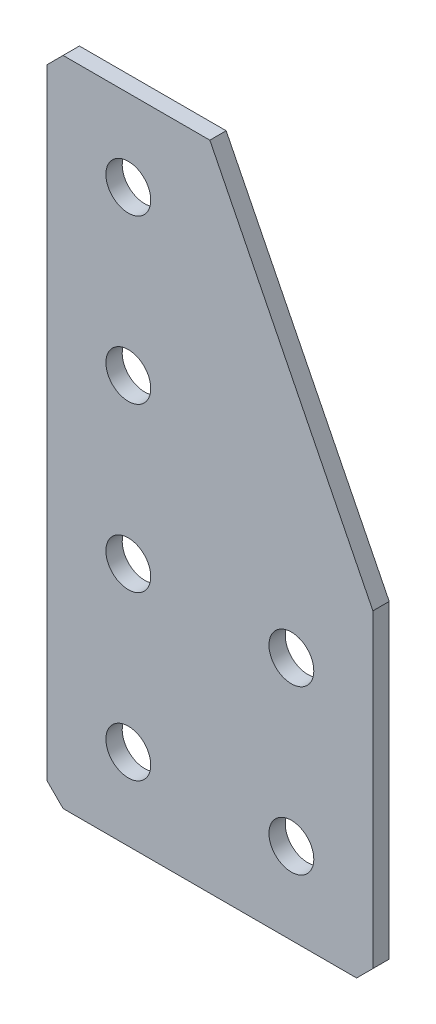
ISO-10303-21;
HEADER;
FILE_DESCRIPTION(('STEP AP214'),'2;1');
FILE_NAME('part.step','',(''),(''),'','','');
FILE_SCHEMA(('AUTOMOTIVE_DESIGN { 1 0 10303 214 1 1 1 1 }'));
ENDSEC;
DATA;
#1=APPLICATION_CONTEXT('core data for automotive mechanical design processes');
#2=APPLICATION_PROTOCOL_DEFINITION('international standard','automotive_design',2000,#1);
#3=PRODUCT_CONTEXT('',#1,'mechanical');
#4=PRODUCT('Part','Part','',(#3));
#5=PRODUCT_RELATED_PRODUCT_CATEGORY('part','',(#4));
#6=PRODUCT_DEFINITION_FORMATION('','',#4);
#7=PRODUCT_DEFINITION_CONTEXT('part definition',#1,'design');
#8=PRODUCT_DEFINITION('design','',#6,#7);
#9=PRODUCT_DEFINITION_SHAPE('','',#8);
#10=(LENGTH_UNIT() NAMED_UNIT(*) SI_UNIT(.MILLI.,.METRE.));
#11=(NAMED_UNIT(*) PLANE_ANGLE_UNIT() SI_UNIT($,.RADIAN.));
#12=(NAMED_UNIT(*) SI_UNIT($,.STERADIAN.) SOLID_ANGLE_UNIT());
#13=UNCERTAINTY_MEASURE_WITH_UNIT(LENGTH_MEASURE(1.E-05),#10,'distance_accuracy_value','');
#14=(GEOMETRIC_REPRESENTATION_CONTEXT(3) GLOBAL_UNCERTAINTY_ASSIGNED_CONTEXT((#13)) GLOBAL_UNIT_ASSIGNED_CONTEXT((#10,
#11,#12)) REPRESENTATION_CONTEXT('',''));
#15=CARTESIAN_POINT('',(0.,0.,0.));
#16=DIRECTION('',(0.,0.,1.));
#17=DIRECTION('',(1.,0.,0.));
#18=AXIS2_PLACEMENT_3D('',#15,#16,#17);
#19=CARTESIAN_POINT('',(20.,0.,-2.));
#20=DIRECTION('',(0.,-1.,0.));
#21=DIRECTION('',(1.,0.,0.));
#22=AXIS2_PLACEMENT_3D('',#19,#20,#21);
#23=PLANE('',#22);
#24=DIRECTION('',(1.,0.,0.));
#25=VECTOR('',#24,1.);
#26=CARTESIAN_POINT('',(20.,0.,-2.));
#27=LINE('',#26,#25);
#28=CARTESIAN_POINT('',(2.00000000000002,0.,-2.));
#29=VERTEX_POINT('',#28);
#30=CARTESIAN_POINT('',(20.,0.,-2.));
#31=VERTEX_POINT('',#30);
#32=EDGE_CURVE('E110',#29,#31,#27,.T.);
#33=ORIENTED_EDGE('',*,*,#32,.F.);
#34=DIRECTION('',(0.,0.,1.));
#35=VECTOR('',#34,1.);
#36=CARTESIAN_POINT('',(2.00000000000002,0.,-2.));
#37=LINE('',#36,#35);
#38=CARTESIAN_POINT('',(2.00000000000002,0.,0.));
#39=VERTEX_POINT('',#38);
#40=EDGE_CURVE('E139',#29,#39,#37,.T.);
#41=ORIENTED_EDGE('',*,*,#40,.T.);
#42=DIRECTION('',(1.,0.,0.));
#43=VECTOR('',#42,1.);
#44=CARTESIAN_POINT('',(20.,0.,0.));
#45=LINE('',#44,#43);
#46=CARTESIAN_POINT('',(20.,0.,0.));
#47=VERTEX_POINT('',#46);
#48=EDGE_CURVE('E136',#39,#47,#45,.T.);
#49=ORIENTED_EDGE('',*,*,#48,.T.);
#50=DIRECTION('',(0.,0.,1.));
#51=VECTOR('',#50,1.);
#52=CARTESIAN_POINT('',(20.,0.,-2.));
#53=LINE('',#52,#51);
#54=EDGE_CURVE('E128',#31,#47,#53,.T.);
#55=ORIENTED_EDGE('',*,*,#54,.F.);
#56=EDGE_LOOP('',(#33,#41,#49,#55));
#57=FACE_BOUND('',#56,.T.);
#58=ADVANCED_FACE('F45',(#57),#23,.F.);
#59=CARTESIAN_POINT('',(40.,-40.,-2.));
#60=DIRECTION('',(-0.894427190999916,-0.447213595499958,0.));
#61=DIRECTION('',(0.447213595499958,-0.894427190999916,0.));
#62=AXIS2_PLACEMENT_3D('',#59,#60,#61);
#63=PLANE('',#62);
#64=DIRECTION('',(0.447213595499958,-0.894427190999916,0.));
#65=VECTOR('',#64,1.);
#66=CARTESIAN_POINT('',(40.,-40.,0.));
#67=LINE('',#66,#65);
#68=CARTESIAN_POINT('',(40.,-40.,0.));
#69=VERTEX_POINT('',#68);
#70=EDGE_CURVE('E197',#47,#69,#67,.T.);
#71=ORIENTED_EDGE('',*,*,#70,.T.);
#72=DIRECTION('',(0.,0.,1.));
#73=VECTOR('',#72,1.);
#74=CARTESIAN_POINT('',(40.,-40.,-2.));
#75=LINE('',#74,#73);
#76=CARTESIAN_POINT('',(40.,-40.,-2.));
#77=VERTEX_POINT('',#76);
#78=EDGE_CURVE('E130',#77,#69,#75,.T.);
#79=ORIENTED_EDGE('',*,*,#78,.F.);
#80=DIRECTION('',(0.447213595499958,-0.894427190999916,0.));
#81=VECTOR('',#80,1.);
#82=CARTESIAN_POINT('',(40.,-40.,-2.));
#83=LINE('',#82,#81);
#84=EDGE_CURVE('E114',#31,#77,#83,.T.);
#85=ORIENTED_EDGE('',*,*,#84,.F.);
#86=ORIENTED_EDGE('',*,*,#54,.T.);
#87=EDGE_LOOP('',(#71,#79,#85,#86));
#88=FACE_BOUND('',#87,.T.);
#89=ADVANCED_FACE('F127',(#88),#63,.F.);
#90=CARTESIAN_POINT('',(40.,-80.,-2.));
#91=DIRECTION('',(-1.,0.,0.));
#92=DIRECTION('',(0.,0.,1.));
#93=AXIS2_PLACEMENT_3D('',#90,#91,#92);
#94=PLANE('',#93);
#95=DIRECTION('',(0.,-1.,0.));
#96=VECTOR('',#95,1.);
#97=CARTESIAN_POINT('',(40.,-80.,0.));
#98=LINE('',#97,#96);
#99=CARTESIAN_POINT('',(40.,-78.,0.));
#100=VERTEX_POINT('',#99);
#101=EDGE_CURVE('E190',#69,#100,#98,.T.);
#102=ORIENTED_EDGE('',*,*,#101,.T.);
#103=DIRECTION('',(0.,0.,-1.));
#104=VECTOR('',#103,1.);
#105=CARTESIAN_POINT('',(40.,-78.,-2.));
#106=LINE('',#105,#104);
#107=CARTESIAN_POINT('',(40.,-78.,-2.));
#108=VERTEX_POINT('',#107);
#109=EDGE_CURVE('E11',#100,#108,#106,.T.);
#110=ORIENTED_EDGE('',*,*,#109,.T.);
#111=DIRECTION('',(0.,-1.,0.));
#112=VECTOR('',#111,1.);
#113=CARTESIAN_POINT('',(40.,-80.,-2.));
#114=LINE('',#113,#112);
#115=EDGE_CURVE('E133',#77,#108,#114,.T.);
#116=ORIENTED_EDGE('',*,*,#115,.F.);
#117=ORIENTED_EDGE('',*,*,#78,.T.);
#118=EDGE_LOOP('',(#102,#110,#116,#117));
#119=FACE_BOUND('',#118,.T.);
#120=ADVANCED_FACE('F297',(#119),#94,.F.);
#121=CARTESIAN_POINT('',(0.,-80.,-2.));
#122=DIRECTION('',(0.,1.,0.));
#123=DIRECTION('',(0.,0.,1.));
#124=AXIS2_PLACEMENT_3D('',#121,#122,#123);
#125=PLANE('',#124);
#126=DIRECTION('',(-1.,0.,0.));
#127=VECTOR('',#126,1.);
#128=CARTESIAN_POINT('',(0.,-80.,-2.));
#129=LINE('',#128,#127);
#130=CARTESIAN_POINT('',(38.,-80.,-2.));
#131=VERTEX_POINT('',#130);
#132=CARTESIAN_POINT('',(2.,-80.,-2.));
#133=VERTEX_POINT('',#132);
#134=EDGE_CURVE('E182',#131,#133,#129,.T.);
#135=ORIENTED_EDGE('',*,*,#134,.F.);
#136=DIRECTION('',(0.,0.,1.));
#137=VECTOR('',#136,1.);
#138=CARTESIAN_POINT('',(38.,-80.,-2.));
#139=LINE('',#138,#137);
#140=CARTESIAN_POINT('',(38.,-80.,0.));
#141=VERTEX_POINT('',#140);
#142=EDGE_CURVE('E54',#131,#141,#139,.T.);
#143=ORIENTED_EDGE('',*,*,#142,.T.);
#144=DIRECTION('',(-1.,0.,0.));
#145=VECTOR('',#144,1.);
#146=CARTESIAN_POINT('',(0.,-80.,0.));
#147=LINE('',#146,#145);
#148=CARTESIAN_POINT('',(2.,-80.,0.));
#149=VERTEX_POINT('',#148);
#150=EDGE_CURVE('E181',#141,#149,#147,.T.);
#151=ORIENTED_EDGE('',*,*,#150,.T.);
#152=DIRECTION('',(0.,0.,-1.));
#153=VECTOR('',#152,1.);
#154=CARTESIAN_POINT('',(2.,-80.,-2.));
#155=LINE('',#154,#153);
#156=EDGE_CURVE('E61',#149,#133,#155,.T.);
#157=ORIENTED_EDGE('',*,*,#156,.T.);
#158=EDGE_LOOP('',(#135,#143,#151,#157));
#159=FACE_BOUND('',#158,.T.);
#160=ADVANCED_FACE('F180',(#159),#125,.F.);
#161=CARTESIAN_POINT('',(0.,0.,-2.));
#162=DIRECTION('',(1.,0.,0.));
#163=DIRECTION('',(0.,0.,-1.));
#164=AXIS2_PLACEMENT_3D('',#161,#162,#163);
#165=PLANE('',#164);
#166=DIRECTION('',(0.,1.,0.));
#167=VECTOR('',#166,1.);
#168=CARTESIAN_POINT('',(0.,0.,0.));
#169=LINE('',#168,#167);
#170=CARTESIAN_POINT('',(0.,-78.,0.));
#171=VERTEX_POINT('',#170);
#172=CARTESIAN_POINT('',(0.,-2.00000000000003,0.));
#173=VERTEX_POINT('',#172);
#174=EDGE_CURVE('E123',#171,#173,#169,.T.);
#175=ORIENTED_EDGE('',*,*,#174,.T.);
#176=DIRECTION('',(0.,0.,-1.));
#177=VECTOR('',#176,1.);
#178=CARTESIAN_POINT('',(0.,-2.00000000000003,-2.));
#179=LINE('',#178,#177);
#180=CARTESIAN_POINT('',(0.,-2.00000000000003,-2.));
#181=VERTEX_POINT('',#180);
#182=EDGE_CURVE('E163',#173,#181,#179,.T.);
#183=ORIENTED_EDGE('',*,*,#182,.T.);
#184=DIRECTION('',(0.,1.,0.));
#185=VECTOR('',#184,1.);
#186=CARTESIAN_POINT('',(0.,0.,-2.));
#187=LINE('',#186,#185);
#188=CARTESIAN_POINT('',(0.,-78.,-2.));
#189=VERTEX_POINT('',#188);
#190=EDGE_CURVE('E147',#189,#181,#187,.T.);
#191=ORIENTED_EDGE('',*,*,#190,.F.);
#192=DIRECTION('',(0.,0.,1.));
#193=VECTOR('',#192,1.);
#194=CARTESIAN_POINT('',(0.,-78.,-2.));
#195=LINE('',#194,#193);
#196=EDGE_CURVE('E159',#189,#171,#195,.T.);
#197=ORIENTED_EDGE('',*,*,#196,.T.);
#198=EDGE_LOOP('',(#175,#183,#191,#197));
#199=FACE_BOUND('',#198,.T.);
#200=ADVANCED_FACE('F265',(#199),#165,.F.);
#201=CARTESIAN_POINT('',(0.,0.,-2.));
#202=DIRECTION('',(0.,0.,1.));
#203=DIRECTION('',(1.,0.,0.));
#204=AXIS2_PLACEMENT_3D('',#201,#202,#203);
#205=PLANE('',#204);
#206=CARTESIAN_POINT('',(10.,-70.,-2.));
#207=DIRECTION('',(0.,0.,-1.));
#208=DIRECTION('',(0.,1.,0.));
#209=AXIS2_PLACEMENT_3D('',#206,#207,#208);
#210=CIRCLE('',#209,2.75);
#211=CARTESIAN_POINT('',(10.,-67.25,-2.));
#212=VERTEX_POINT('',#211);
#213=EDGE_CURVE('E254',#212,#212,#210,.T.);
#214=ORIENTED_EDGE('',*,*,#213,.F.);
#215=EDGE_LOOP('',(#214));
#216=FACE_BOUND('',#215,.T.);
#217=CARTESIAN_POINT('',(10.,-50.,-2.));
#218=DIRECTION('',(0.,0.,-1.));
#219=DIRECTION('',(0.,1.,0.));
#220=AXIS2_PLACEMENT_3D('',#217,#218,#219);
#221=CIRCLE('',#220,2.75);
#222=CARTESIAN_POINT('',(10.,-47.25,-2.));
#223=VERTEX_POINT('',#222);
#224=EDGE_CURVE('E246',#223,#223,#221,.T.);
#225=ORIENTED_EDGE('',*,*,#224,.F.);
#226=EDGE_LOOP('',(#225));
#227=FACE_BOUND('',#226,.T.);
#228=CARTESIAN_POINT('',(10.,-30.,-2.));
#229=DIRECTION('',(0.,0.,-1.));
#230=DIRECTION('',(0.,1.,0.));
#231=AXIS2_PLACEMENT_3D('',#228,#229,#230);
#232=CIRCLE('',#231,2.75);
#233=CARTESIAN_POINT('',(10.,-27.25,-2.));
#234=VERTEX_POINT('',#233);
#235=EDGE_CURVE('E238',#234,#234,#232,.T.);
#236=ORIENTED_EDGE('',*,*,#235,.F.);
#237=EDGE_LOOP('',(#236));
#238=FACE_BOUND('',#237,.T.);
#239=CARTESIAN_POINT('',(10.,-9.99999999999999,-2.));
#240=DIRECTION('',(0.,0.,-1.));
#241=DIRECTION('',(0.,1.,0.));
#242=AXIS2_PLACEMENT_3D('',#239,#240,#241);
#243=CIRCLE('',#242,2.75);
#244=CARTESIAN_POINT('',(10.,-7.24999999999999,-2.));
#245=VERTEX_POINT('',#244);
#246=EDGE_CURVE('E230',#245,#245,#243,.T.);
#247=ORIENTED_EDGE('',*,*,#246,.F.);
#248=EDGE_LOOP('',(#247));
#249=FACE_BOUND('',#248,.T.);
#250=CARTESIAN_POINT('',(30.,-70.,-2.));
#251=DIRECTION('',(0.,0.,-1.));
#252=DIRECTION('',(0.,1.,0.));
#253=AXIS2_PLACEMENT_3D('',#250,#251,#252);
#254=CIRCLE('',#253,2.75);
#255=CARTESIAN_POINT('',(30.,-67.25,-2.));
#256=VERTEX_POINT('',#255);
#257=EDGE_CURVE('E222',#256,#256,#254,.T.);
#258=ORIENTED_EDGE('',*,*,#257,.F.);
#259=EDGE_LOOP('',(#258));
#260=FACE_BOUND('',#259,.T.);
#261=CARTESIAN_POINT('',(30.,-50.,-2.));
#262=DIRECTION('',(0.,0.,-1.));
#263=DIRECTION('',(0.,1.,0.));
#264=AXIS2_PLACEMENT_3D('',#261,#262,#263);
#265=CIRCLE('',#264,2.75);
#266=CARTESIAN_POINT('',(30.,-47.25,-2.));
#267=VERTEX_POINT('',#266);
#268=EDGE_CURVE('E214',#267,#267,#265,.T.);
#269=ORIENTED_EDGE('',*,*,#268,.F.);
#270=EDGE_LOOP('',(#269));
#271=FACE_BOUND('',#270,.T.);
#272=ORIENTED_EDGE('',*,*,#190,.T.);
#273=DIRECTION('',(-0.707106781186545,-0.70710678118655,0.));
#274=VECTOR('',#273,1.);
#275=CARTESIAN_POINT('',(2.00000000000002,0.,-2.));
#276=LINE('',#275,#274);
#277=EDGE_CURVE('E117',#181,#29,#276,.F.);
#278=ORIENTED_EDGE('',*,*,#277,.T.);
#279=ORIENTED_EDGE('',*,*,#32,.T.);
#280=ORIENTED_EDGE('',*,*,#84,.T.);
#281=ORIENTED_EDGE('',*,*,#115,.T.);
#282=DIRECTION('',(0.707106781186548,0.707106781186548,0.));
#283=VECTOR('',#282,1.);
#284=CARTESIAN_POINT('',(38.,-80.,-2.));
#285=LINE('',#284,#283);
#286=EDGE_CURVE('E68',#108,#131,#285,.F.);
#287=ORIENTED_EDGE('',*,*,#286,.T.);
#288=ORIENTED_EDGE('',*,*,#134,.T.);
#289=DIRECTION('',(0.70710678118655,-0.707106781186545,0.));
#290=VECTOR('',#289,1.);
#291=CARTESIAN_POINT('',(0.,-78.,-2.));
#292=LINE('',#291,#290);
#293=EDGE_CURVE('E166',#133,#189,#292,.F.);
#294=ORIENTED_EDGE('',*,*,#293,.T.);
#295=EDGE_LOOP('',(#272,#278,#279,#280,#281,#287,#288,#294));
#296=FACE_BOUND('',#295,.T.);
#297=ADVANCED_FACE('F113',(#216,#227,#238,#249,#260,#271,#296),#205,.F.);
#298=CARTESIAN_POINT('',(0.,0.,0.));
#299=DIRECTION('',(0.,0.,1.));
#300=DIRECTION('',(1.,0.,0.));
#301=AXIS2_PLACEMENT_3D('',#298,#299,#300);
#302=PLANE('',#301);
#303=CARTESIAN_POINT('',(10.,-70.,0.));
#304=DIRECTION('',(0.,0.,-1.));
#305=DIRECTION('',(0.,1.,0.));
#306=AXIS2_PLACEMENT_3D('',#303,#304,#305);
#307=CIRCLE('',#306,2.75);
#308=CARTESIAN_POINT('',(10.,-67.25,0.));
#309=VERTEX_POINT('',#308);
#310=EDGE_CURVE('E250',#309,#309,#307,.T.);
#311=ORIENTED_EDGE('',*,*,#310,.T.);
#312=EDGE_LOOP('',(#311));
#313=FACE_BOUND('',#312,.T.);
#314=CARTESIAN_POINT('',(10.,-50.,0.));
#315=DIRECTION('',(0.,0.,-1.));
#316=DIRECTION('',(0.,1.,0.));
#317=AXIS2_PLACEMENT_3D('',#314,#315,#316);
#318=CIRCLE('',#317,2.75);
#319=CARTESIAN_POINT('',(10.,-47.25,0.));
#320=VERTEX_POINT('',#319);
#321=EDGE_CURVE('E242',#320,#320,#318,.T.);
#322=ORIENTED_EDGE('',*,*,#321,.T.);
#323=EDGE_LOOP('',(#322));
#324=FACE_BOUND('',#323,.T.);
#325=CARTESIAN_POINT('',(10.,-30.,0.));
#326=DIRECTION('',(0.,0.,-1.));
#327=DIRECTION('',(0.,1.,0.));
#328=AXIS2_PLACEMENT_3D('',#325,#326,#327);
#329=CIRCLE('',#328,2.75);
#330=CARTESIAN_POINT('',(10.,-27.25,0.));
#331=VERTEX_POINT('',#330);
#332=EDGE_CURVE('E234',#331,#331,#329,.T.);
#333=ORIENTED_EDGE('',*,*,#332,.T.);
#334=EDGE_LOOP('',(#333));
#335=FACE_BOUND('',#334,.T.);
#336=CARTESIAN_POINT('',(10.,-9.99999999999999,0.));
#337=DIRECTION('',(0.,0.,-1.));
#338=DIRECTION('',(0.,1.,0.));
#339=AXIS2_PLACEMENT_3D('',#336,#337,#338);
#340=CIRCLE('',#339,2.75);
#341=CARTESIAN_POINT('',(10.,-7.25,0.));
#342=VERTEX_POINT('',#341);
#343=EDGE_CURVE('E226',#342,#342,#340,.T.);
#344=ORIENTED_EDGE('',*,*,#343,.T.);
#345=EDGE_LOOP('',(#344));
#346=FACE_BOUND('',#345,.T.);
#347=CARTESIAN_POINT('',(30.,-70.,0.));
#348=DIRECTION('',(0.,0.,-1.));
#349=DIRECTION('',(0.,1.,0.));
#350=AXIS2_PLACEMENT_3D('',#347,#348,#349);
#351=CIRCLE('',#350,2.75);
#352=CARTESIAN_POINT('',(30.,-67.25,0.));
#353=VERTEX_POINT('',#352);
#354=EDGE_CURVE('E218',#353,#353,#351,.T.);
#355=ORIENTED_EDGE('',*,*,#354,.T.);
#356=EDGE_LOOP('',(#355));
#357=FACE_BOUND('',#356,.T.);
#358=CARTESIAN_POINT('',(30.,-50.,0.));
#359=DIRECTION('',(0.,0.,-1.));
#360=DIRECTION('',(0.,1.,0.));
#361=AXIS2_PLACEMENT_3D('',#358,#359,#360);
#362=CIRCLE('',#361,2.75);
#363=CARTESIAN_POINT('',(30.,-47.25,0.));
#364=VERTEX_POINT('',#363);
#365=EDGE_CURVE('E204',#364,#364,#362,.T.);
#366=ORIENTED_EDGE('',*,*,#365,.T.);
#367=EDGE_LOOP('',(#366));
#368=FACE_BOUND('',#367,.T.);
#369=ORIENTED_EDGE('',*,*,#48,.F.);
#370=DIRECTION('',(0.707106781186545,0.70710678118655,0.));
#371=VECTOR('',#370,1.);
#372=CARTESIAN_POINT('',(1.00000000000001,-1.00000000000001,0.));
#373=LINE('',#372,#371);
#374=EDGE_CURVE('E156',#39,#173,#373,.F.);
#375=ORIENTED_EDGE('',*,*,#374,.T.);
#376=ORIENTED_EDGE('',*,*,#174,.F.);
#377=DIRECTION('',(-0.70710678118655,0.707106781186545,0.));
#378=VECTOR('',#377,1.);
#379=CARTESIAN_POINT('',(-39.,-39.0000000000003,0.));
#380=LINE('',#379,#378);
#381=EDGE_CURVE('E145',#171,#149,#380,.F.);
#382=ORIENTED_EDGE('',*,*,#381,.T.);
#383=ORIENTED_EDGE('',*,*,#150,.F.);
#384=DIRECTION('',(-0.707106781186548,-0.707106781186548,0.));
#385=VECTOR('',#384,1.);
#386=CARTESIAN_POINT('',(59.,-59.,0.));
#387=LINE('',#386,#385);
#388=EDGE_CURVE('E153',#141,#100,#387,.F.);
#389=ORIENTED_EDGE('',*,*,#388,.T.);
#390=ORIENTED_EDGE('',*,*,#101,.F.);
#391=ORIENTED_EDGE('',*,*,#70,.F.);
#392=EDGE_LOOP('',(#369,#375,#376,#382,#383,#389,#390,#391));
#393=FACE_BOUND('',#392,.T.);
#394=ADVANCED_FACE('F185',(#313,#324,#335,#346,#357,#368,#393),#302,.T.);
#395=CARTESIAN_POINT('',(30.,-50.,-2.));
#396=DIRECTION('',(0.,0.,-1.));
#397=DIRECTION('',(0.,1.,0.));
#398=AXIS2_PLACEMENT_3D('',#395,#396,#397);
#399=CYLINDRICAL_SURFACE('',#398,2.75);
#400=ORIENTED_EDGE('',*,*,#365,.F.);
#401=EDGE_LOOP('',(#400));
#402=FACE_BOUND('',#401,.T.);
#403=ORIENTED_EDGE('',*,*,#268,.T.);
#404=EDGE_LOOP('',(#403));
#405=FACE_BOUND('',#404,.T.);
#406=ADVANCED_FACE('F277',(#402,#405),#399,.F.);
#407=CARTESIAN_POINT('',(30.,-70.,-2.));
#408=DIRECTION('',(0.,0.,-1.));
#409=DIRECTION('',(0.,1.,0.));
#410=AXIS2_PLACEMENT_3D('',#407,#408,#409);
#411=CYLINDRICAL_SURFACE('',#410,2.75);
#412=ORIENTED_EDGE('',*,*,#354,.F.);
#413=EDGE_LOOP('',(#412));
#414=FACE_BOUND('',#413,.T.);
#415=ORIENTED_EDGE('',*,*,#257,.T.);
#416=EDGE_LOOP('',(#415));
#417=FACE_BOUND('',#416,.T.);
#418=ADVANCED_FACE('F279',(#414,#417),#411,.F.);
#419=CARTESIAN_POINT('',(10.,-9.99999999999999,-2.));
#420=DIRECTION('',(0.,0.,-1.));
#421=DIRECTION('',(0.,1.,0.));
#422=AXIS2_PLACEMENT_3D('',#419,#420,#421);
#423=CYLINDRICAL_SURFACE('',#422,2.75);
#424=ORIENTED_EDGE('',*,*,#343,.F.);
#425=EDGE_LOOP('',(#424));
#426=FACE_BOUND('',#425,.T.);
#427=ORIENTED_EDGE('',*,*,#246,.T.);
#428=EDGE_LOOP('',(#427));
#429=FACE_BOUND('',#428,.T.);
#430=ADVANCED_FACE('F286',(#426,#429),#423,.F.);
#431=CARTESIAN_POINT('',(10.,-30.,-2.));
#432=DIRECTION('',(0.,0.,-1.));
#433=DIRECTION('',(0.,1.,0.));
#434=AXIS2_PLACEMENT_3D('',#431,#432,#433);
#435=CYLINDRICAL_SURFACE('',#434,2.75);
#436=ORIENTED_EDGE('',*,*,#332,.F.);
#437=EDGE_LOOP('',(#436));
#438=FACE_BOUND('',#437,.T.);
#439=ORIENTED_EDGE('',*,*,#235,.T.);
#440=EDGE_LOOP('',(#439));
#441=FACE_BOUND('',#440,.T.);
#442=ADVANCED_FACE('F361',(#438,#441),#435,.F.);
#443=CARTESIAN_POINT('',(10.,-50.,-2.));
#444=DIRECTION('',(0.,0.,-1.));
#445=DIRECTION('',(0.,1.,0.));
#446=AXIS2_PLACEMENT_3D('',#443,#444,#445);
#447=CYLINDRICAL_SURFACE('',#446,2.75);
#448=ORIENTED_EDGE('',*,*,#321,.F.);
#449=EDGE_LOOP('',(#448));
#450=FACE_BOUND('',#449,.T.);
#451=ORIENTED_EDGE('',*,*,#224,.T.);
#452=EDGE_LOOP('',(#451));
#453=FACE_BOUND('',#452,.T.);
#454=ADVANCED_FACE('F370',(#450,#453),#447,.F.);
#455=CARTESIAN_POINT('',(10.,-70.,-2.));
#456=DIRECTION('',(0.,0.,-1.));
#457=DIRECTION('',(0.,1.,0.));
#458=AXIS2_PLACEMENT_3D('',#455,#456,#457);
#459=CYLINDRICAL_SURFACE('',#458,2.75);
#460=ORIENTED_EDGE('',*,*,#310,.F.);
#461=EDGE_LOOP('',(#460));
#462=FACE_BOUND('',#461,.T.);
#463=ORIENTED_EDGE('',*,*,#213,.T.);
#464=EDGE_LOOP('',(#463));
#465=FACE_BOUND('',#464,.T.);
#466=ADVANCED_FACE('F261',(#462,#465),#459,.F.);
#467=CARTESIAN_POINT('',(2.00000000000002,0.,-2.));
#468=DIRECTION('',(0.70710678118655,-0.707106781186545,0.));
#469=DIRECTION('',(0.,0.,1.));
#470=AXIS2_PLACEMENT_3D('',#467,#468,#469);
#471=PLANE('',#470);
#472=ORIENTED_EDGE('',*,*,#277,.F.);
#473=ORIENTED_EDGE('',*,*,#182,.F.);
#474=ORIENTED_EDGE('',*,*,#374,.F.);
#475=ORIENTED_EDGE('',*,*,#40,.F.);
#476=EDGE_LOOP('',(#472,#473,#474,#475));
#477=FACE_BOUND('',#476,.T.);
#478=ADVANCED_FACE('F301',(#477),#471,.F.);
#479=CARTESIAN_POINT('',(38.,-80.,-2.));
#480=DIRECTION('',(-0.707106781186547,0.707106781186547,0.));
#481=DIRECTION('',(0.,0.,1.));
#482=AXIS2_PLACEMENT_3D('',#479,#480,#481);
#483=PLANE('',#482);
#484=ORIENTED_EDGE('',*,*,#286,.F.);
#485=ORIENTED_EDGE('',*,*,#109,.F.);
#486=ORIENTED_EDGE('',*,*,#388,.F.);
#487=ORIENTED_EDGE('',*,*,#142,.F.);
#488=EDGE_LOOP('',(#484,#485,#486,#487));
#489=FACE_BOUND('',#488,.T.);
#490=ADVANCED_FACE('F303',(#489),#483,.F.);
#491=CARTESIAN_POINT('',(0.,-78.,-2.));
#492=DIRECTION('',(0.707106781186545,0.70710678118655,0.));
#493=DIRECTION('',(0.,0.,1.));
#494=AXIS2_PLACEMENT_3D('',#491,#492,#493);
#495=PLANE('',#494);
#496=ORIENTED_EDGE('',*,*,#293,.F.);
#497=ORIENTED_EDGE('',*,*,#156,.F.);
#498=ORIENTED_EDGE('',*,*,#381,.F.);
#499=ORIENTED_EDGE('',*,*,#196,.F.);
#500=EDGE_LOOP('',(#496,#497,#498,#499));
#501=FACE_BOUND('',#500,.T.);
#502=ADVANCED_FACE('F47',(#501),#495,.F.);
#503=CLOSED_SHELL('',(#58,#89,#120,#160,#200,#297,#394,#406,#418,#430,#442,#454,#466,#478,#490,#502));
#504=MANIFOLD_SOLID_BREP('B2',#503);
#505=ADVANCED_BREP_SHAPE_REPRESENTATION('',(#18,#504),#14);
#506=SHAPE_DEFINITION_REPRESENTATION(#9,#505);
ENDSEC;
END-ISO-10303-21;
